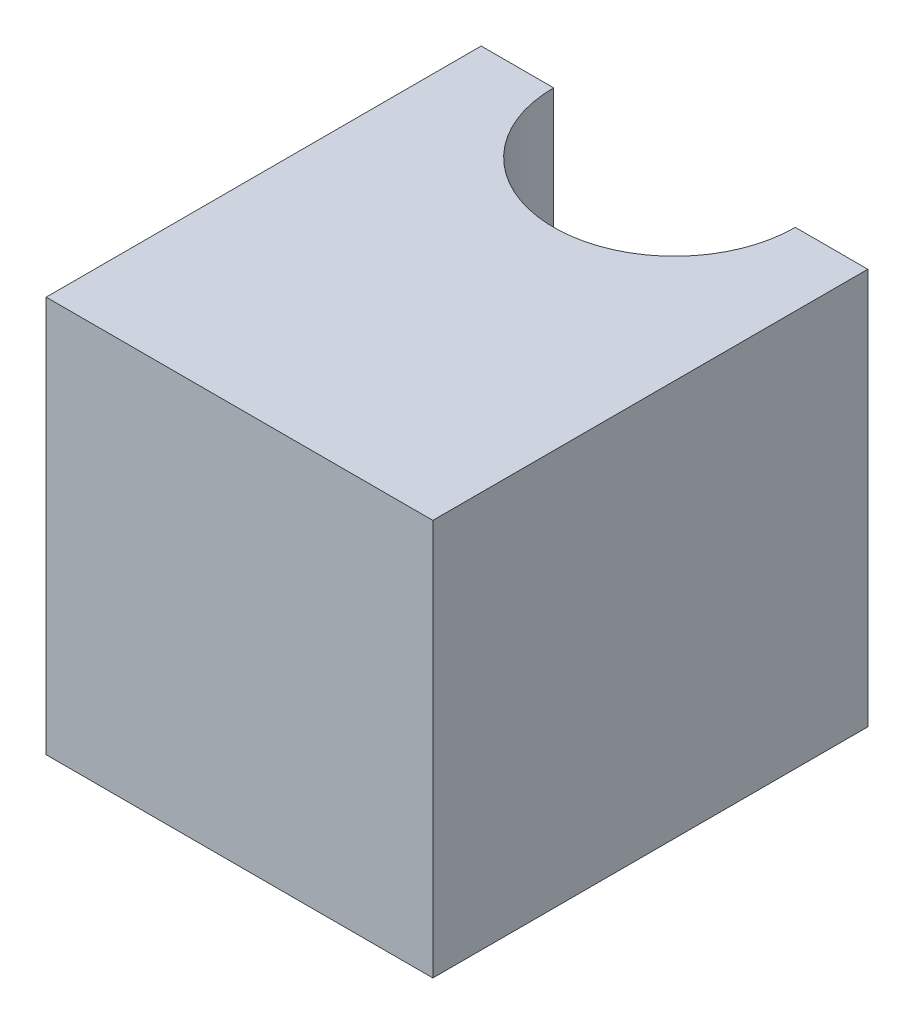
ISO-10303-21;
HEADER;
FILE_DESCRIPTION(('STEP AP214'),'2;1');
FILE_NAME('part.step','',(''),(''),'','','');
FILE_SCHEMA(('AUTOMOTIVE_DESIGN { 1 0 10303 214 1 1 1 1 }'));
ENDSEC;
DATA;
#1=APPLICATION_CONTEXT('core data for automotive mechanical design processes');
#2=APPLICATION_PROTOCOL_DEFINITION('international standard','automotive_design',2000,#1);
#3=PRODUCT_CONTEXT('',#1,'mechanical');
#4=PRODUCT('Part','Part','',(#3));
#5=PRODUCT_RELATED_PRODUCT_CATEGORY('part','',(#4));
#6=PRODUCT_DEFINITION_FORMATION('','',#4);
#7=PRODUCT_DEFINITION_CONTEXT('part definition',#1,'design');
#8=PRODUCT_DEFINITION('design','',#6,#7);
#9=PRODUCT_DEFINITION_SHAPE('','',#8);
#10=(LENGTH_UNIT() NAMED_UNIT(*) SI_UNIT(.MILLI.,.METRE.));
#11=(NAMED_UNIT(*) PLANE_ANGLE_UNIT() SI_UNIT($,.RADIAN.));
#12=(NAMED_UNIT(*) SI_UNIT($,.STERADIAN.) SOLID_ANGLE_UNIT());
#13=UNCERTAINTY_MEASURE_WITH_UNIT(LENGTH_MEASURE(1.E-05),#10,'distance_accuracy_value','');
#14=(GEOMETRIC_REPRESENTATION_CONTEXT(3) GLOBAL_UNCERTAINTY_ASSIGNED_CONTEXT((#13)) GLOBAL_UNIT_ASSIGNED_CONTEXT((#10,
#11,#12)) REPRESENTATION_CONTEXT('',''));
#15=CARTESIAN_POINT('',(0.,0.,0.));
#16=DIRECTION('',(0.,0.,1.));
#17=DIRECTION('',(1.,0.,0.));
#18=AXIS2_PLACEMENT_3D('',#15,#16,#17);
#19=CARTESIAN_POINT('',(5.2,0.,-5.2));
#20=DIRECTION('',(1.,0.,0.));
#21=DIRECTION('',(0.,0.,-1.));
#22=AXIS2_PLACEMENT_3D('',#19,#20,#21);
#23=PLANE('',#22);
#24=DIRECTION('',(0.,0.,1.));
#25=VECTOR('',#24,1.);
#26=CARTESIAN_POINT('',(5.2,0.82,-5.65));
#27=LINE('',#26,#25);
#28=CARTESIAN_POINT('',(5.2,0.82,-5.2));
#29=VERTEX_POINT('',#28);
#30=CARTESIAN_POINT('',(5.2,0.82,-6.1));
#31=VERTEX_POINT('',#30);
#32=EDGE_CURVE('E108',#29,#31,#27,.F.);
#33=ORIENTED_EDGE('',*,*,#32,.F.);
#34=DIRECTION('',(0.,1.,0.));
#35=VECTOR('',#34,1.);
#36=CARTESIAN_POINT('',(5.2,0.,-5.2));
#37=LINE('',#36,#35);
#38=CARTESIAN_POINT('',(5.2,0.,-5.2));
#39=VERTEX_POINT('',#38);
#40=EDGE_CURVE('E92',#39,#29,#37,.T.);
#41=ORIENTED_EDGE('',*,*,#40,.F.);
#42=DIRECTION('',(0.,0.,1.));
#43=VECTOR('',#42,1.);
#44=CARTESIAN_POINT('',(5.2,0.,-5.65));
#45=LINE('',#44,#43);
#46=CARTESIAN_POINT('',(5.2,0.,-6.1));
#47=VERTEX_POINT('',#46);
#48=EDGE_CURVE('E76',#39,#47,#45,.F.);
#49=ORIENTED_EDGE('',*,*,#48,.T.);
#50=DIRECTION('',(0.,1.,0.));
#51=VECTOR('',#50,1.);
#52=CARTESIAN_POINT('',(5.2,0.,-6.1));
#53=LINE('',#52,#51);
#54=EDGE_CURVE('E73',#31,#47,#53,.F.);
#55=ORIENTED_EDGE('',*,*,#54,.F.);
#56=EDGE_LOOP('',(#33,#41,#49,#55));
#57=FACE_BOUND('',#56,.T.);
#58=ADVANCED_FACE('F17',(#57),#23,.T.);
#59=CARTESIAN_POINT('',(5.2,0.,-6.1));
#60=DIRECTION('',(0.,0.,-1.));
#61=DIRECTION('',(-1.,0.,0.));
#62=AXIS2_PLACEMENT_3D('',#59,#60,#61);
#63=PLANE('',#62);
#64=DIRECTION('',(1.,0.,0.));
#65=VECTOR('',#64,1.);
#66=CARTESIAN_POINT('',(4.8,0.82,-6.1));
#67=LINE('',#66,#65);
#68=CARTESIAN_POINT('',(5.05,0.82,-6.1));
#69=VERTEX_POINT('',#68);
#70=EDGE_CURVE('E106',#31,#69,#67,.F.);
#71=ORIENTED_EDGE('',*,*,#70,.F.);
#72=ORIENTED_EDGE('',*,*,#54,.T.);
#73=DIRECTION('',(1.,0.,0.));
#74=VECTOR('',#73,1.);
#75=CARTESIAN_POINT('',(4.8,0.,-6.1));
#76=LINE('',#75,#74);
#77=CARTESIAN_POINT('',(5.05,0.,-6.1));
#78=VERTEX_POINT('',#77);
#79=EDGE_CURVE('E67',#47,#78,#76,.F.);
#80=ORIENTED_EDGE('',*,*,#79,.T.);
#81=DIRECTION('',(0.,1.,0.));
#82=VECTOR('',#81,1.);
#83=CARTESIAN_POINT('',(5.05,0.,-6.1));
#84=LINE('',#83,#82);
#85=EDGE_CURVE('E71',#78,#69,#84,.T.);
#86=ORIENTED_EDGE('',*,*,#85,.T.);
#87=EDGE_LOOP('',(#71,#72,#80,#86));
#88=FACE_BOUND('',#87,.T.);
#89=ADVANCED_FACE('F70',(#88),#63,.T.);
#90=CARTESIAN_POINT('',(4.8,0.,-6.1));
#91=DIRECTION('',(0.,1.,0.));
#92=DIRECTION('',(0.,0.,1.));
#93=AXIS2_PLACEMENT_3D('',#90,#91,#92);
#94=CYLINDRICAL_SURFACE('',#93,0.25);
#95=DIRECTION('',(0.,1.,0.));
#96=VECTOR('',#95,1.);
#97=CARTESIAN_POINT('',(4.55,0.,-6.1));
#98=LINE('',#97,#96);
#99=CARTESIAN_POINT('',(4.55,0.82,-6.1));
#100=VERTEX_POINT('',#99);
#101=CARTESIAN_POINT('',(4.55,0.,-6.1));
#102=VERTEX_POINT('',#101);
#103=EDGE_CURVE('E117',#100,#102,#98,.F.);
#104=ORIENTED_EDGE('',*,*,#103,.F.);
#105=CARTESIAN_POINT('',(4.8,0.82,-6.1));
#106=DIRECTION('',(0.,1.,0.));
#107=DIRECTION('',(0.,0.,1.));
#108=AXIS2_PLACEMENT_3D('',#105,#106,#107);
#109=CIRCLE('',#108,0.25);
#110=EDGE_CURVE('E83',#69,#100,#109,.F.);
#111=ORIENTED_EDGE('',*,*,#110,.F.);
#112=ORIENTED_EDGE('',*,*,#85,.F.);
#113=CARTESIAN_POINT('',(4.8,0.,-6.1));
#114=DIRECTION('',(0.,1.,0.));
#115=DIRECTION('',(0.,0.,1.));
#116=AXIS2_PLACEMENT_3D('',#113,#114,#115);
#117=CIRCLE('',#116,0.25);
#118=EDGE_CURVE('E20',#78,#102,#117,.F.);
#119=ORIENTED_EDGE('',*,*,#118,.T.);
#120=EDGE_LOOP('',(#104,#111,#112,#119));
#121=FACE_BOUND('',#120,.T.);
#122=ADVANCED_FACE('F81',(#121),#94,.F.);
#123=CARTESIAN_POINT('',(4.8,0.,-5.65));
#124=DIRECTION('',(0.,1.,0.));
#125=DIRECTION('',(0.,0.,1.));
#126=AXIS2_PLACEMENT_3D('',#123,#124,#125);
#127=PLANE('',#126);
#128=DIRECTION('',(0.,0.,1.));
#129=VECTOR('',#128,1.);
#130=CARTESIAN_POINT('',(4.4,0.,-6.1));
#131=LINE('',#130,#129);
#132=CARTESIAN_POINT('',(4.4,0.,-6.1));
#133=VERTEX_POINT('',#132);
#134=CARTESIAN_POINT('',(4.4,0.,-5.2));
#135=VERTEX_POINT('',#134);
#136=EDGE_CURVE('E119',#133,#135,#131,.T.);
#137=ORIENTED_EDGE('',*,*,#136,.F.);
#138=DIRECTION('',(-1.,0.,0.));
#139=VECTOR('',#138,1.);
#140=CARTESIAN_POINT('',(4.55,0.,-6.1));
#141=LINE('',#140,#139);
#142=EDGE_CURVE('E88',#102,#133,#141,.T.);
#143=ORIENTED_EDGE('',*,*,#142,.F.);
#144=ORIENTED_EDGE('',*,*,#118,.F.);
#145=ORIENTED_EDGE('',*,*,#79,.F.);
#146=ORIENTED_EDGE('',*,*,#48,.F.);
#147=DIRECTION('',(1.,0.,0.));
#148=VECTOR('',#147,1.);
#149=CARTESIAN_POINT('',(4.4,0.,-5.2));
#150=LINE('',#149,#148);
#151=EDGE_CURVE('E90',#135,#39,#150,.T.);
#152=ORIENTED_EDGE('',*,*,#151,.F.);
#153=EDGE_LOOP('',(#137,#143,#144,#145,#146,#152));
#154=FACE_BOUND('',#153,.T.);
#155=ADVANCED_FACE('F86',(#154),#127,.F.);
#156=CARTESIAN_POINT('',(4.4,0.,-5.2));
#157=DIRECTION('',(0.,0.,1.));
#158=DIRECTION('',(1.,0.,0.));
#159=AXIS2_PLACEMENT_3D('',#156,#157,#158);
#160=PLANE('',#159);
#161=DIRECTION('',(1.,0.,0.));
#162=VECTOR('',#161,1.);
#163=CARTESIAN_POINT('',(4.8,0.82,-5.2));
#164=LINE('',#163,#162);
#165=CARTESIAN_POINT('',(4.4,0.82,-5.2));
#166=VERTEX_POINT('',#165);
#167=EDGE_CURVE('E96',#166,#29,#164,.T.);
#168=ORIENTED_EDGE('',*,*,#167,.F.);
#169=DIRECTION('',(0.,1.,0.));
#170=VECTOR('',#169,1.);
#171=CARTESIAN_POINT('',(4.4,0.,-5.2));
#172=LINE('',#171,#170);
#173=EDGE_CURVE('E127',#135,#166,#172,.T.);
#174=ORIENTED_EDGE('',*,*,#173,.F.);
#175=ORIENTED_EDGE('',*,*,#151,.T.);
#176=ORIENTED_EDGE('',*,*,#40,.T.);
#177=EDGE_LOOP('',(#168,#174,#175,#176));
#178=FACE_BOUND('',#177,.T.);
#179=ADVANCED_FACE('F149',(#178),#160,.T.);
#180=CARTESIAN_POINT('',(4.8,0.82,-5.65));
#181=DIRECTION('',(0.,1.,0.));
#182=DIRECTION('',(0.,0.,1.));
#183=AXIS2_PLACEMENT_3D('',#180,#181,#182);
#184=PLANE('',#183);
#185=DIRECTION('',(-1.,0.,0.));
#186=VECTOR('',#185,1.);
#187=CARTESIAN_POINT('',(4.55,0.82,-6.1));
#188=LINE('',#187,#186);
#189=CARTESIAN_POINT('',(4.4,0.82,-6.1));
#190=VERTEX_POINT('',#189);
#191=EDGE_CURVE('E35',#190,#100,#188,.F.);
#192=ORIENTED_EDGE('',*,*,#191,.F.);
#193=DIRECTION('',(0.,0.,1.));
#194=VECTOR('',#193,1.);
#195=CARTESIAN_POINT('',(4.4,0.82,-6.1));
#196=LINE('',#195,#194);
#197=EDGE_CURVE('E26',#166,#190,#196,.F.);
#198=ORIENTED_EDGE('',*,*,#197,.F.);
#199=ORIENTED_EDGE('',*,*,#167,.T.);
#200=ORIENTED_EDGE('',*,*,#32,.T.);
#201=ORIENTED_EDGE('',*,*,#70,.T.);
#202=ORIENTED_EDGE('',*,*,#110,.T.);
#203=EDGE_LOOP('',(#192,#198,#199,#200,#201,#202));
#204=FACE_BOUND('',#203,.T.);
#205=ADVANCED_FACE('F152',(#204),#184,.T.);
#206=CARTESIAN_POINT('',(4.55,0.,-6.1));
#207=DIRECTION('',(0.,0.,-1.));
#208=DIRECTION('',(-1.,0.,0.));
#209=AXIS2_PLACEMENT_3D('',#206,#207,#208);
#210=PLANE('',#209);
#211=ORIENTED_EDGE('',*,*,#191,.T.);
#212=ORIENTED_EDGE('',*,*,#103,.T.);
#213=ORIENTED_EDGE('',*,*,#142,.T.);
#214=DIRECTION('',(0.,1.,0.));
#215=VECTOR('',#214,1.);
#216=CARTESIAN_POINT('',(4.4,0.,-6.1));
#217=LINE('',#216,#215);
#218=EDGE_CURVE('E11',#190,#133,#217,.F.);
#219=ORIENTED_EDGE('',*,*,#218,.F.);
#220=EDGE_LOOP('',(#211,#212,#213,#219));
#221=FACE_BOUND('',#220,.T.);
#222=ADVANCED_FACE('F154',(#221),#210,.T.);
#223=CARTESIAN_POINT('',(4.4,0.,-6.1));
#224=DIRECTION('',(-1.,0.,0.));
#225=DIRECTION('',(0.,0.,1.));
#226=AXIS2_PLACEMENT_3D('',#223,#224,#225);
#227=PLANE('',#226);
#228=ORIENTED_EDGE('',*,*,#197,.T.);
#229=ORIENTED_EDGE('',*,*,#218,.T.);
#230=ORIENTED_EDGE('',*,*,#136,.T.);
#231=ORIENTED_EDGE('',*,*,#173,.T.);
#232=EDGE_LOOP('',(#228,#229,#230,#231));
#233=FACE_BOUND('',#232,.T.);
#234=ADVANCED_FACE('F148',(#233),#227,.T.);
#235=CLOSED_SHELL('',(#58,#89,#122,#155,#179,#205,#222,#234));
#236=MANIFOLD_SOLID_BREP('B1',#235);
#237=ADVANCED_BREP_SHAPE_REPRESENTATION('',(#18,#236),#14);
#238=SHAPE_DEFINITION_REPRESENTATION(#9,#237);
ENDSEC;
END-ISO-10303-21;
